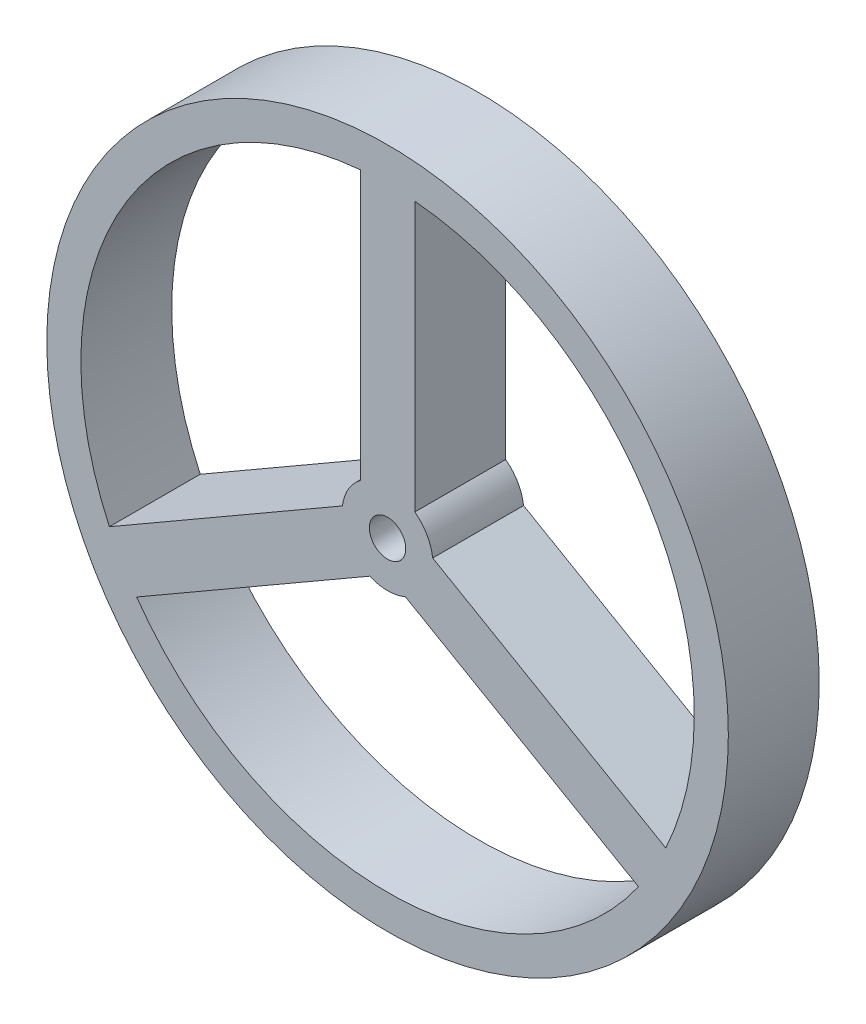
ISO-10303-21;
HEADER;
FILE_DESCRIPTION(('STEP AP214'),'2;1');
FILE_NAME('part.step','',(''),(''),'','','');
FILE_SCHEMA(('AUTOMOTIVE_DESIGN { 1 0 10303 214 1 1 1 1 }'));
ENDSEC;
DATA;
#1=APPLICATION_CONTEXT('core data for automotive mechanical design processes');
#2=APPLICATION_PROTOCOL_DEFINITION('international standard','automotive_design',2000,#1);
#3=PRODUCT_CONTEXT('',#1,'mechanical');
#4=PRODUCT('Part','Part','',(#3));
#5=PRODUCT_RELATED_PRODUCT_CATEGORY('part','',(#4));
#6=PRODUCT_DEFINITION_FORMATION('','',#4);
#7=PRODUCT_DEFINITION_CONTEXT('part definition',#1,'design');
#8=PRODUCT_DEFINITION('design','',#6,#7);
#9=PRODUCT_DEFINITION_SHAPE('','',#8);
#10=(LENGTH_UNIT() NAMED_UNIT(*) SI_UNIT(.MILLI.,.METRE.));
#11=(NAMED_UNIT(*) PLANE_ANGLE_UNIT() SI_UNIT($,.RADIAN.));
#12=(NAMED_UNIT(*) SI_UNIT($,.STERADIAN.) SOLID_ANGLE_UNIT());
#13=UNCERTAINTY_MEASURE_WITH_UNIT(LENGTH_MEASURE(1.E-05),#10,'distance_accuracy_value','');
#14=(GEOMETRIC_REPRESENTATION_CONTEXT(3) GLOBAL_UNCERTAINTY_ASSIGNED_CONTEXT((#13)) GLOBAL_UNIT_ASSIGNED_CONTEXT((#10,
#11,#12)) REPRESENTATION_CONTEXT('',''));
#15=CARTESIAN_POINT('',(0.,0.,0.));
#16=DIRECTION('',(0.,0.,1.));
#17=DIRECTION('',(1.,0.,0.));
#18=AXIS2_PLACEMENT_3D('',#15,#16,#17);
#19=CARTESIAN_POINT('',(0.,0.,2.));
#20=DIRECTION('',(0.,0.,-1.));
#21=DIRECTION('',(-1.,0.,0.));
#22=AXIS2_PLACEMENT_3D('',#19,#20,#21);
#23=CYLINDRICAL_SURFACE('',#22,1.);
#24=CARTESIAN_POINT('',(0.,0.,0.));
#25=DIRECTION('',(0.,0.,1.));
#26=DIRECTION('',(1.,0.,0.));
#27=AXIS2_PLACEMENT_3D('',#24,#25,#26);
#28=CIRCLE('',#27,1.);
#29=CARTESIAN_POINT('',(-0.6,0.8,0.));
#30=VERTEX_POINT('',#29);
#31=CARTESIAN_POINT('',(-0.992820323027551,0.119615242270663,0.));
#32=VERTEX_POINT('',#31);
#33=EDGE_CURVE('E223',#30,#32,#28,.T.);
#34=ORIENTED_EDGE('',*,*,#33,.T.);
#35=DIRECTION('',(0.,0.,-1.));
#36=VECTOR('',#35,1.);
#37=CARTESIAN_POINT('',(-0.992820323027551,0.119615242270663,2.));
#38=LINE('',#37,#36);
#39=CARTESIAN_POINT('',(-0.992820323027551,0.119615242270663,2.));
#40=VERTEX_POINT('',#39);
#41=EDGE_CURVE('E11',#40,#32,#38,.T.);
#42=ORIENTED_EDGE('',*,*,#41,.F.);
#43=CARTESIAN_POINT('',(0.,0.,2.));
#44=DIRECTION('',(0.,0.,1.));
#45=DIRECTION('',(1.,0.,0.));
#46=AXIS2_PLACEMENT_3D('',#43,#44,#45);
#47=CIRCLE('',#46,1.);
#48=CARTESIAN_POINT('',(-0.6,0.8,2.));
#49=VERTEX_POINT('',#48);
#50=EDGE_CURVE('E142',#49,#40,#47,.T.);
#51=ORIENTED_EDGE('',*,*,#50,.F.);
#52=DIRECTION('',(0.,0.,-1.));
#53=VECTOR('',#52,1.);
#54=CARTESIAN_POINT('',(-0.6,0.8,2.));
#55=LINE('',#54,#53);
#56=EDGE_CURVE('E57',#49,#30,#55,.T.);
#57=ORIENTED_EDGE('',*,*,#56,.T.);
#58=EDGE_LOOP('',(#34,#42,#51,#57));
#59=FACE_BOUND('',#58,.T.);
#60=ADVANCED_FACE('F38',(#59),#23,.T.);
#61=CARTESIAN_POINT('',(-0.29999999999999,0.519615242270659,2.));
#62=DIRECTION('',(0.499999999999991,-0.866025403784444,0.));
#63=DIRECTION('',(0.866025403784444,0.499999999999991,0.));
#64=AXIS2_PLACEMENT_3D('',#61,#62,#63);
#65=PLANE('',#64);
#66=DIRECTION('',(-0.866025403784444,-0.499999999999991,0.));
#67=VECTOR('',#66,1.);
#68=CARTESIAN_POINT('',(-0.29999999999999,0.519615242270659,0.));
#69=LINE('',#68,#67);
#70=CARTESIAN_POINT('',(-6.12253166586497,-2.84202498238153,0.));
#71=VERTEX_POINT('',#70);
#72=EDGE_CURVE('E148',#32,#71,#69,.T.);
#73=ORIENTED_EDGE('',*,*,#72,.T.);
#74=DIRECTION('',(0.,0.,-1.));
#75=VECTOR('',#74,1.);
#76=CARTESIAN_POINT('',(-6.12253166586497,-2.84202498238153,2.));
#77=LINE('',#76,#75);
#78=CARTESIAN_POINT('',(-6.12253166586497,-2.84202498238153,2.));
#79=VERTEX_POINT('',#78);
#80=EDGE_CURVE('E48',#79,#71,#77,.T.);
#81=ORIENTED_EDGE('',*,*,#80,.F.);
#82=DIRECTION('',(-0.866025403784444,-0.499999999999991,0.));
#83=VECTOR('',#82,1.);
#84=CARTESIAN_POINT('',(-0.29999999999999,0.519615242270659,2.));
#85=LINE('',#84,#83);
#86=EDGE_CURVE('E135',#40,#79,#85,.T.);
#87=ORIENTED_EDGE('',*,*,#86,.F.);
#88=ORIENTED_EDGE('',*,*,#41,.T.);
#89=EDGE_LOOP('',(#73,#81,#87,#88));
#90=FACE_BOUND('',#89,.T.);
#91=ADVANCED_FACE('F147',(#90),#65,.F.);
#92=CARTESIAN_POINT('',(0.,0.,2.));
#93=DIRECTION('',(0.,0.,-1.));
#94=DIRECTION('',(-1.,0.,0.));
#95=AXIS2_PLACEMENT_3D('',#92,#93,#94);
#96=CYLINDRICAL_SURFACE('',#95,6.75);
#97=CARTESIAN_POINT('',(0.,0.,0.));
#98=DIRECTION('',(0.,0.,1.));
#99=DIRECTION('',(1.,0.,0.));
#100=AXIS2_PLACEMENT_3D('',#97,#98,#99);
#101=CIRCLE('',#100,6.75);
#102=CARTESIAN_POINT('',(-0.6,6.72328044930449,0.));
#103=VERTEX_POINT('',#102);
#104=EDGE_CURVE('E233',#103,#71,#101,.T.);
#105=ORIENTED_EDGE('',*,*,#104,.F.);
#106=DIRECTION('',(0.,0.,-1.));
#107=VECTOR('',#106,1.);
#108=CARTESIAN_POINT('',(-0.6,6.72328044930449,2.));
#109=LINE('',#108,#107);
#110=CARTESIAN_POINT('',(-0.6,6.72328044930449,2.));
#111=VERTEX_POINT('',#110);
#112=EDGE_CURVE('E95',#111,#103,#109,.T.);
#113=ORIENTED_EDGE('',*,*,#112,.F.);
#114=CARTESIAN_POINT('',(0.,0.,2.));
#115=DIRECTION('',(0.,0.,1.));
#116=DIRECTION('',(1.,0.,0.));
#117=AXIS2_PLACEMENT_3D('',#114,#115,#116);
#118=CIRCLE('',#117,6.75);
#119=EDGE_CURVE('E141',#111,#79,#118,.T.);
#120=ORIENTED_EDGE('',*,*,#119,.T.);
#121=ORIENTED_EDGE('',*,*,#80,.T.);
#122=EDGE_LOOP('',(#105,#113,#120,#121));
#123=FACE_BOUND('',#122,.T.);
#124=ADVANCED_FACE('F152',(#123),#96,.F.);
#125=CARTESIAN_POINT('',(0.299999999999999,-0.519615242270673,2.));
#126=DIRECTION('',(0.499999999999991,-0.866025403784444,0.));
#127=DIRECTION('',(0.866025403784444,0.499999999999991,0.));
#128=AXIS2_PLACEMENT_3D('',#125,#126,#127);
#129=PLANE('',#128);
#130=DIRECTION('',(-0.866025403784444,-0.499999999999991,0.));
#131=VECTOR('',#130,1.);
#132=CARTESIAN_POINT('',(0.299999999999999,-0.519615242270673,0.));
#133=LINE('',#132,#131);
#134=CARTESIAN_POINT('',(-0.392820323027551,-0.919615242270663,0.));
#135=VERTEX_POINT('',#134);
#136=CARTESIAN_POINT('',(-5.52253166586498,-3.88125546692286,0.));
#137=VERTEX_POINT('',#136);
#138=EDGE_CURVE('E232',#135,#137,#133,.T.);
#139=ORIENTED_EDGE('',*,*,#138,.F.);
#140=DIRECTION('',(0.,0.,-1.));
#141=VECTOR('',#140,1.);
#142=CARTESIAN_POINT('',(-0.392820323027551,-0.919615242270663,2.));
#143=LINE('',#142,#141);
#144=CARTESIAN_POINT('',(-0.392820323027551,-0.919615242270663,2.));
#145=VERTEX_POINT('',#144);
#146=EDGE_CURVE('E190',#145,#135,#143,.T.);
#147=ORIENTED_EDGE('',*,*,#146,.F.);
#148=DIRECTION('',(-0.866025403784444,-0.499999999999991,0.));
#149=VECTOR('',#148,1.);
#150=CARTESIAN_POINT('',(0.299999999999999,-0.519615242270673,2.));
#151=LINE('',#150,#149);
#152=CARTESIAN_POINT('',(-5.52253166586498,-3.88125546692286,2.));
#153=VERTEX_POINT('',#152);
#154=EDGE_CURVE('E164',#145,#153,#151,.T.);
#155=ORIENTED_EDGE('',*,*,#154,.T.);
#156=DIRECTION('',(0.,0.,-1.));
#157=VECTOR('',#156,1.);
#158=CARTESIAN_POINT('',(-5.52253166586498,-3.88125546692286,2.));
#159=LINE('',#158,#157);
#160=EDGE_CURVE('E192',#153,#137,#159,.T.);
#161=ORIENTED_EDGE('',*,*,#160,.T.);
#162=EDGE_LOOP('',(#139,#147,#155,#161));
#163=FACE_BOUND('',#162,.T.);
#164=ADVANCED_FACE('F252',(#163),#129,.T.);
#165=CARTESIAN_POINT('',(0.392820323027551,-0.919615242270663,0.));
#166=VERTEX_POINT('',#165);
#167=EDGE_CURVE('E224',#135,#166,#28,.T.);
#168=ORIENTED_EDGE('',*,*,#167,.T.);
#169=DIRECTION('',(0.,0.,-1.));
#170=VECTOR('',#169,1.);
#171=CARTESIAN_POINT('',(0.392820323027551,-0.919615242270663,2.));
#172=LINE('',#171,#170);
#173=CARTESIAN_POINT('',(0.392820323027551,-0.919615242270663,2.));
#174=VERTEX_POINT('',#173);
#175=EDGE_CURVE('E196',#174,#166,#172,.T.);
#176=ORIENTED_EDGE('',*,*,#175,.F.);
#177=EDGE_CURVE('E169',#145,#174,#47,.T.);
#178=ORIENTED_EDGE('',*,*,#177,.F.);
#179=ORIENTED_EDGE('',*,*,#146,.T.);
#180=EDGE_LOOP('',(#168,#176,#178,#179));
#181=FACE_BOUND('',#180,.T.);
#182=ADVANCED_FACE('F248',(#181),#23,.T.);
#183=CARTESIAN_POINT('',(-0.3,-0.519615242270658,2.));
#184=DIRECTION('',(0.500000000000005,0.866025403784436,0.));
#185=DIRECTION('',(-0.866025403784436,0.500000000000005,0.));
#186=AXIS2_PLACEMENT_3D('',#183,#184,#185);
#187=PLANE('',#186);
#188=DIRECTION('',(0.866025403784436,-0.500000000000005,0.));
#189=VECTOR('',#188,1.);
#190=CARTESIAN_POINT('',(-0.3,-0.519615242270658,0.));
#191=LINE('',#190,#189);
#192=CARTESIAN_POINT('',(5.52253166586493,-3.88125546692293,0.));
#193=VERTEX_POINT('',#192);
#194=EDGE_CURVE('E237',#166,#193,#191,.T.);
#195=ORIENTED_EDGE('',*,*,#194,.T.);
#196=DIRECTION('',(0.,0.,-1.));
#197=VECTOR('',#196,1.);
#198=CARTESIAN_POINT('',(5.52253166586493,-3.88125546692293,2.));
#199=LINE('',#198,#197);
#200=CARTESIAN_POINT('',(5.52253166586493,-3.88125546692293,2.));
#201=VERTEX_POINT('',#200);
#202=EDGE_CURVE('E194',#201,#193,#199,.T.);
#203=ORIENTED_EDGE('',*,*,#202,.F.);
#204=DIRECTION('',(0.866025403784436,-0.500000000000005,0.));
#205=VECTOR('',#204,1.);
#206=CARTESIAN_POINT('',(-0.3,-0.519615242270658,2.));
#207=LINE('',#206,#205);
#208=EDGE_CURVE('E162',#174,#201,#207,.T.);
#209=ORIENTED_EDGE('',*,*,#208,.F.);
#210=ORIENTED_EDGE('',*,*,#175,.T.);
#211=EDGE_LOOP('',(#195,#203,#209,#210));
#212=FACE_BOUND('',#211,.T.);
#213=ADVANCED_FACE('F259',(#212),#187,.F.);
#214=CARTESIAN_POINT('',(0.300000000000005,0.519615242270665,2.));
#215=DIRECTION('',(0.500000000000005,0.866025403784436,0.));
#216=DIRECTION('',(-0.866025403784436,0.500000000000005,0.));
#217=AXIS2_PLACEMENT_3D('',#214,#215,#216);
#218=PLANE('',#217);
#219=DIRECTION('',(0.866025403784436,-0.500000000000005,0.));
#220=VECTOR('',#219,1.);
#221=CARTESIAN_POINT('',(0.300000000000005,0.519615242270665,0.));
#222=LINE('',#221,#220);
#223=CARTESIAN_POINT('',(0.992820323027551,0.119615242270663,0.));
#224=VERTEX_POINT('',#223);
#225=CARTESIAN_POINT('',(6.12253166586493,-2.84202498238161,0.));
#226=VERTEX_POINT('',#225);
#227=EDGE_CURVE('E219',#224,#226,#222,.T.);
#228=ORIENTED_EDGE('',*,*,#227,.F.);
#229=DIRECTION('',(0.,0.,-1.));
#230=VECTOR('',#229,1.);
#231=CARTESIAN_POINT('',(0.992820323027551,0.119615242270663,2.));
#232=LINE('',#231,#230);
#233=CARTESIAN_POINT('',(0.992820323027551,0.119615242270663,2.));
#234=VERTEX_POINT('',#233);
#235=EDGE_CURVE('E42',#234,#224,#232,.T.);
#236=ORIENTED_EDGE('',*,*,#235,.F.);
#237=DIRECTION('',(0.866025403784436,-0.500000000000005,0.));
#238=VECTOR('',#237,1.);
#239=CARTESIAN_POINT('',(0.300000000000005,0.519615242270665,2.));
#240=LINE('',#239,#238);
#241=CARTESIAN_POINT('',(6.12253166586493,-2.84202498238161,2.));
#242=VERTEX_POINT('',#241);
#243=EDGE_CURVE('E174',#234,#242,#240,.T.);
#244=ORIENTED_EDGE('',*,*,#243,.T.);
#245=DIRECTION('',(0.,0.,-1.));
#246=VECTOR('',#245,1.);
#247=CARTESIAN_POINT('',(6.12253166586493,-2.84202498238161,2.));
#248=LINE('',#247,#246);
#249=EDGE_CURVE('E200',#242,#226,#248,.T.);
#250=ORIENTED_EDGE('',*,*,#249,.T.);
#251=EDGE_LOOP('',(#228,#236,#244,#250));
#252=FACE_BOUND('',#251,.T.);
#253=ADVANCED_FACE('F40',(#252),#218,.T.);
#254=CARTESIAN_POINT('',(0.6,0.8,0.));
#255=VERTEX_POINT('',#254);
#256=EDGE_CURVE('E213',#224,#255,#28,.T.);
#257=ORIENTED_EDGE('',*,*,#256,.T.);
#258=DIRECTION('',(0.,0.,-1.));
#259=VECTOR('',#258,1.);
#260=CARTESIAN_POINT('',(0.6,0.8,2.));
#261=LINE('',#260,#259);
#262=CARTESIAN_POINT('',(0.6,0.8,2.));
#263=VERTEX_POINT('',#262);
#264=EDGE_CURVE('E204',#263,#255,#261,.T.);
#265=ORIENTED_EDGE('',*,*,#264,.F.);
#266=EDGE_CURVE('E170',#234,#263,#47,.T.);
#267=ORIENTED_EDGE('',*,*,#266,.F.);
#268=ORIENTED_EDGE('',*,*,#235,.T.);
#269=EDGE_LOOP('',(#257,#265,#267,#268));
#270=FACE_BOUND('',#269,.T.);
#271=ADVANCED_FACE('F212',(#270),#23,.T.);
#272=CARTESIAN_POINT('',(0.6,0.,2.));
#273=DIRECTION('',(-1.,0.,0.));
#274=DIRECTION('',(0.,-1.,0.));
#275=AXIS2_PLACEMENT_3D('',#272,#273,#274);
#276=PLANE('',#275);
#277=DIRECTION('',(0.,1.,0.));
#278=VECTOR('',#277,1.);
#279=CARTESIAN_POINT('',(0.6,0.,0.));
#280=LINE('',#279,#278);
#281=CARTESIAN_POINT('',(0.6,6.72328044930449,0.));
#282=VERTEX_POINT('',#281);
#283=EDGE_CURVE('E221',#255,#282,#280,.T.);
#284=ORIENTED_EDGE('',*,*,#283,.T.);
#285=DIRECTION('',(0.,0.,-1.));
#286=VECTOR('',#285,1.);
#287=CARTESIAN_POINT('',(0.6,6.72328044930449,2.));
#288=LINE('',#287,#286);
#289=CARTESIAN_POINT('',(0.6,6.72328044930449,2.));
#290=VERTEX_POINT('',#289);
#291=EDGE_CURVE('E202',#290,#282,#288,.T.);
#292=ORIENTED_EDGE('',*,*,#291,.F.);
#293=DIRECTION('',(0.,1.,0.));
#294=VECTOR('',#293,1.);
#295=CARTESIAN_POINT('',(0.6,0.,2.));
#296=LINE('',#295,#294);
#297=EDGE_CURVE('E165',#263,#290,#296,.T.);
#298=ORIENTED_EDGE('',*,*,#297,.F.);
#299=ORIENTED_EDGE('',*,*,#264,.T.);
#300=EDGE_LOOP('',(#284,#292,#298,#299));
#301=FACE_BOUND('',#300,.T.);
#302=ADVANCED_FACE('F282',(#301),#276,.F.);
#303=CARTESIAN_POINT('',(0.,0.,2.));
#304=DIRECTION('',(0.,0.,-1.));
#305=DIRECTION('',(-1.,0.,0.));
#306=AXIS2_PLACEMENT_3D('',#303,#304,#305);
#307=CYLINDRICAL_SURFACE('',#306,7.5);
#308=CARTESIAN_POINT('',(0.,0.,2.));
#309=DIRECTION('',(0.,0.,1.));
#310=DIRECTION('',(1.,0.,0.));
#311=AXIS2_PLACEMENT_3D('',#308,#309,#310);
#312=CIRCLE('',#311,7.5);
#313=CARTESIAN_POINT('',(7.5,0.,2.));
#314=VERTEX_POINT('',#313);
#315=EDGE_CURVE('E157',#314,#314,#312,.T.);
#316=ORIENTED_EDGE('',*,*,#315,.F.);
#317=EDGE_LOOP('',(#316));
#318=FACE_BOUND('',#317,.T.);
#319=CARTESIAN_POINT('',(0.,0.,0.));
#320=DIRECTION('',(0.,0.,1.));
#321=DIRECTION('',(1.,0.,0.));
#322=AXIS2_PLACEMENT_3D('',#319,#320,#321);
#323=CIRCLE('',#322,7.5);
#324=CARTESIAN_POINT('',(7.5,0.,0.));
#325=VERTEX_POINT('',#324);
#326=EDGE_CURVE('E180',#325,#325,#323,.T.);
#327=ORIENTED_EDGE('',*,*,#326,.T.);
#328=EDGE_LOOP('',(#327));
#329=FACE_BOUND('',#328,.T.);
#330=ADVANCED_FACE('F294',(#318,#329),#307,.T.);
#331=CARTESIAN_POINT('',(-0.6,0.,2.));
#332=DIRECTION('',(-1.,0.,0.));
#333=DIRECTION('',(0.,0.,1.));
#334=AXIS2_PLACEMENT_3D('',#331,#332,#333);
#335=PLANE('',#334);
#336=DIRECTION('',(0.,1.,0.));
#337=VECTOR('',#336,1.);
#338=CARTESIAN_POINT('',(-0.6,0.,0.));
#339=LINE('',#338,#337);
#340=EDGE_CURVE('E185',#30,#103,#339,.T.);
#341=ORIENTED_EDGE('',*,*,#340,.F.);
#342=ORIENTED_EDGE('',*,*,#56,.F.);
#343=DIRECTION('',(0.,1.,0.));
#344=VECTOR('',#343,1.);
#345=CARTESIAN_POINT('',(-0.6,0.,2.));
#346=LINE('',#345,#344);
#347=EDGE_CURVE('E153',#49,#111,#346,.T.);
#348=ORIENTED_EDGE('',*,*,#347,.T.);
#349=ORIENTED_EDGE('',*,*,#112,.T.);
#350=EDGE_LOOP('',(#341,#342,#348,#349));
#351=FACE_BOUND('',#350,.T.);
#352=ADVANCED_FACE('F298',(#351),#335,.T.);
#353=EDGE_CURVE('E234',#137,#193,#101,.T.);
#354=ORIENTED_EDGE('',*,*,#353,.F.);
#355=ORIENTED_EDGE('',*,*,#160,.F.);
#356=EDGE_CURVE('E155',#153,#201,#118,.T.);
#357=ORIENTED_EDGE('',*,*,#356,.T.);
#358=ORIENTED_EDGE('',*,*,#202,.T.);
#359=EDGE_LOOP('',(#354,#355,#357,#358));
#360=FACE_BOUND('',#359,.T.);
#361=ADVANCED_FACE('F256',(#360),#96,.F.);
#362=EDGE_CURVE('E230',#226,#282,#101,.T.);
#363=ORIENTED_EDGE('',*,*,#362,.F.);
#364=ORIENTED_EDGE('',*,*,#249,.F.);
#365=EDGE_CURVE('E156',#242,#290,#118,.T.);
#366=ORIENTED_EDGE('',*,*,#365,.T.);
#367=ORIENTED_EDGE('',*,*,#291,.T.);
#368=EDGE_LOOP('',(#363,#364,#366,#367));
#369=FACE_BOUND('',#368,.T.);
#370=ADVANCED_FACE('F271',(#369),#96,.F.);
#371=CARTESIAN_POINT('',(0.,0.,2.));
#372=DIRECTION('',(0.,0.,-1.));
#373=DIRECTION('',(-1.,0.,0.));
#374=AXIS2_PLACEMENT_3D('',#371,#372,#373);
#375=CYLINDRICAL_SURFACE('',#374,0.4);
#376=CARTESIAN_POINT('',(0.,0.,2.));
#377=DIRECTION('',(0.,0.,1.));
#378=DIRECTION('',(1.,0.,0.));
#379=AXIS2_PLACEMENT_3D('',#376,#377,#378);
#380=CIRCLE('',#379,0.4);
#381=CARTESIAN_POINT('',(0.4,0.,2.));
#382=VERTEX_POINT('',#381);
#383=EDGE_CURVE('E203',#382,#382,#380,.T.);
#384=ORIENTED_EDGE('',*,*,#383,.T.);
#385=EDGE_LOOP('',(#384));
#386=FACE_BOUND('',#385,.T.);
#387=CARTESIAN_POINT('',(0.,0.,0.));
#388=DIRECTION('',(0.,0.,1.));
#389=DIRECTION('',(1.,0.,0.));
#390=AXIS2_PLACEMENT_3D('',#387,#388,#389);
#391=CIRCLE('',#390,0.4);
#392=CARTESIAN_POINT('',(0.4,0.,0.));
#393=VERTEX_POINT('',#392);
#394=EDGE_CURVE('E177',#393,#393,#391,.T.);
#395=ORIENTED_EDGE('',*,*,#394,.F.);
#396=EDGE_LOOP('',(#395));
#397=FACE_BOUND('',#396,.T.);
#398=ADVANCED_FACE('F264',(#386,#397),#375,.F.);
#399=CARTESIAN_POINT('',(0.,0.,2.));
#400=DIRECTION('',(0.,0.,1.));
#401=DIRECTION('',(1.,0.,0.));
#402=AXIS2_PLACEMENT_3D('',#399,#400,#401);
#403=PLANE('',#402);
#404=ORIENTED_EDGE('',*,*,#243,.F.);
#405=ORIENTED_EDGE('',*,*,#266,.T.);
#406=ORIENTED_EDGE('',*,*,#297,.T.);
#407=ORIENTED_EDGE('',*,*,#365,.F.);
#408=EDGE_LOOP('',(#404,#405,#406,#407));
#409=FACE_BOUND('',#408,.T.);
#410=ORIENTED_EDGE('',*,*,#154,.F.);
#411=ORIENTED_EDGE('',*,*,#177,.T.);
#412=ORIENTED_EDGE('',*,*,#208,.T.);
#413=ORIENTED_EDGE('',*,*,#356,.F.);
#414=EDGE_LOOP('',(#410,#411,#412,#413));
#415=FACE_BOUND('',#414,.T.);
#416=ORIENTED_EDGE('',*,*,#50,.T.);
#417=ORIENTED_EDGE('',*,*,#86,.T.);
#418=ORIENTED_EDGE('',*,*,#119,.F.);
#419=ORIENTED_EDGE('',*,*,#347,.F.);
#420=EDGE_LOOP('',(#416,#417,#418,#419));
#421=FACE_BOUND('',#420,.T.);
#422=ORIENTED_EDGE('',*,*,#315,.T.);
#423=EDGE_LOOP('',(#422));
#424=FACE_BOUND('',#423,.T.);
#425=ORIENTED_EDGE('',*,*,#383,.F.);
#426=EDGE_LOOP('',(#425));
#427=FACE_BOUND('',#426,.T.);
#428=ADVANCED_FACE('F137',(#409,#415,#421,#424,#427),#403,.T.);
#429=CARTESIAN_POINT('',(0.,0.,0.));
#430=DIRECTION('',(0.,0.,1.));
#431=DIRECTION('',(1.,0.,0.));
#432=AXIS2_PLACEMENT_3D('',#429,#430,#431);
#433=PLANE('',#432);
#434=ORIENTED_EDGE('',*,*,#227,.T.);
#435=ORIENTED_EDGE('',*,*,#362,.T.);
#436=ORIENTED_EDGE('',*,*,#283,.F.);
#437=ORIENTED_EDGE('',*,*,#256,.F.);
#438=EDGE_LOOP('',(#434,#435,#436,#437));
#439=FACE_BOUND('',#438,.T.);
#440=ORIENTED_EDGE('',*,*,#138,.T.);
#441=ORIENTED_EDGE('',*,*,#353,.T.);
#442=ORIENTED_EDGE('',*,*,#194,.F.);
#443=ORIENTED_EDGE('',*,*,#167,.F.);
#444=EDGE_LOOP('',(#440,#441,#442,#443));
#445=FACE_BOUND('',#444,.T.);
#446=ORIENTED_EDGE('',*,*,#33,.F.);
#447=ORIENTED_EDGE('',*,*,#340,.T.);
#448=ORIENTED_EDGE('',*,*,#104,.T.);
#449=ORIENTED_EDGE('',*,*,#72,.F.);
#450=EDGE_LOOP('',(#446,#447,#448,#449));
#451=FACE_BOUND('',#450,.T.);
#452=ORIENTED_EDGE('',*,*,#326,.F.);
#453=EDGE_LOOP('',(#452));
#454=FACE_BOUND('',#453,.T.);
#455=ORIENTED_EDGE('',*,*,#394,.T.);
#456=EDGE_LOOP('',(#455));
#457=FACE_BOUND('',#456,.T.);
#458=ADVANCED_FACE('F216',(#439,#445,#451,#454,#457),#433,.F.);
#459=CLOSED_SHELL('',(#60,#91,#124,#164,#182,#213,#253,#271,#302,#330,#352,#361,#370,#398,#428,#458));
#460=MANIFOLD_SOLID_BREP('B2',#459);
#461=ADVANCED_BREP_SHAPE_REPRESENTATION('',(#18,#460),#14);
#462=SHAPE_DEFINITION_REPRESENTATION(#9,#461);
ENDSEC;
END-ISO-10303-21;
